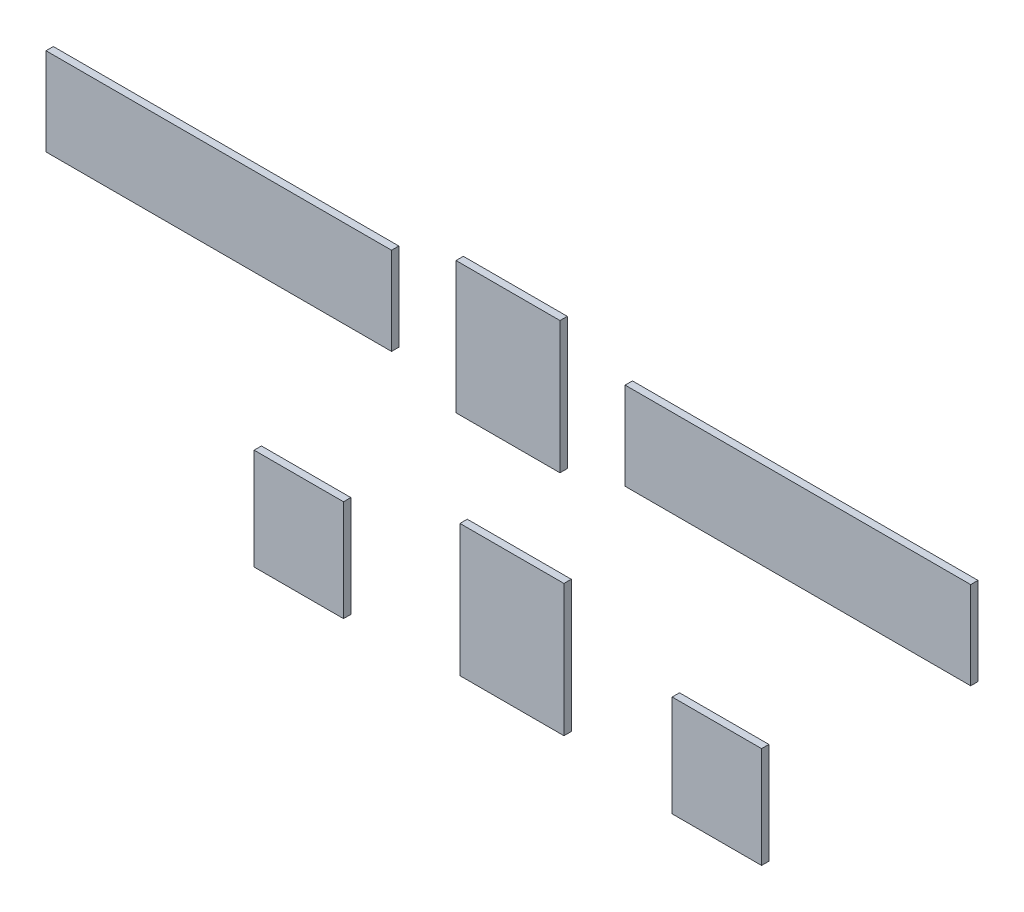
ISO-10303-21;
HEADER;
FILE_DESCRIPTION(('STEP AP214'),'2;1');
FILE_NAME('part.step','',(''),(''),'','','');
FILE_SCHEMA(('AUTOMOTIVE_DESIGN { 1 0 10303 214 1 1 1 1 }'));
ENDSEC;
DATA;
#1=APPLICATION_CONTEXT('core data for automotive mechanical design processes');
#2=APPLICATION_PROTOCOL_DEFINITION('international standard','automotive_design',2000,#1);
#3=PRODUCT_CONTEXT('',#1,'mechanical');
#4=PRODUCT('Part','Part','',(#3));
#5=PRODUCT_RELATED_PRODUCT_CATEGORY('part','',(#4));
#6=PRODUCT_DEFINITION_FORMATION('','',#4);
#7=PRODUCT_DEFINITION_CONTEXT('part definition',#1,'design');
#8=PRODUCT_DEFINITION('design','',#6,#7);
#9=PRODUCT_DEFINITION_SHAPE('','',#8);
#10=(LENGTH_UNIT() NAMED_UNIT(*) SI_UNIT(.MILLI.,.METRE.));
#11=(NAMED_UNIT(*) PLANE_ANGLE_UNIT() SI_UNIT($,.RADIAN.));
#12=(NAMED_UNIT(*) SI_UNIT($,.STERADIAN.) SOLID_ANGLE_UNIT());
#13=UNCERTAINTY_MEASURE_WITH_UNIT(LENGTH_MEASURE(1.E-05),#10,'distance_accuracy_value','');
#14=(GEOMETRIC_REPRESENTATION_CONTEXT(3) GLOBAL_UNCERTAINTY_ASSIGNED_CONTEXT((#13)) GLOBAL_UNIT_ASSIGNED_CONTEXT((#10,
#11,#12)) REPRESENTATION_CONTEXT('',''));
#15=CARTESIAN_POINT('',(0.,0.,0.));
#16=DIRECTION('',(0.,0.,1.));
#17=DIRECTION('',(1.,0.,0.));
#18=AXIS2_PLACEMENT_3D('',#15,#16,#17);
#19=CARTESIAN_POINT('',(225.816228938282,-255.644254605695,6.35));
#20=DIRECTION('',(-1.,0.,0.));
#21=DIRECTION('',(0.,0.,1.));
#22=AXIS2_PLACEMENT_3D('',#19,#20,#21);
#23=PLANE('',#22);
#24=DIRECTION('',(0.,1.,0.));
#25=VECTOR('',#24,1.);
#26=CARTESIAN_POINT('',(225.816228938282,-255.644254605695,0.));
#27=LINE('',#26,#25);
#28=CARTESIAN_POINT('',(225.816228938282,-255.644254605695,0.));
#29=VERTEX_POINT('',#28);
#30=CARTESIAN_POINT('',(225.816228938282,-167.758081574893,0.));
#31=VERTEX_POINT('',#30);
#32=EDGE_CURVE('E113',#29,#31,#27,.T.);
#33=ORIENTED_EDGE('',*,*,#32,.T.);
#34=DIRECTION('',(0.,0.,-1.));
#35=VECTOR('',#34,1.);
#36=CARTESIAN_POINT('',(225.816228938282,-167.758081574893,6.35));
#37=LINE('',#36,#35);
#38=CARTESIAN_POINT('',(225.816228938282,-167.758081574893,6.35));
#39=VERTEX_POINT('',#38);
#40=EDGE_CURVE('E12',#39,#31,#37,.T.);
#41=ORIENTED_EDGE('',*,*,#40,.F.);
#42=DIRECTION('',(0.,1.,0.));
#43=VECTOR('',#42,1.);
#44=CARTESIAN_POINT('',(225.816228938282,-255.644254605695,6.35));
#45=LINE('',#44,#43);
#46=CARTESIAN_POINT('',(225.816228938282,-255.644254605695,6.35));
#47=VERTEX_POINT('',#46);
#48=EDGE_CURVE('E101',#47,#39,#45,.T.);
#49=ORIENTED_EDGE('',*,*,#48,.F.);
#50=DIRECTION('',(0.,0.,-1.));
#51=VECTOR('',#50,1.);
#52=CARTESIAN_POINT('',(225.816228938282,-255.644254605695,6.35));
#53=LINE('',#52,#51);
#54=EDGE_CURVE('E109',#47,#29,#53,.T.);
#55=ORIENTED_EDGE('',*,*,#54,.T.);
#56=EDGE_LOOP('',(#33,#41,#49,#55));
#57=FACE_BOUND('',#56,.T.);
#58=ADVANCED_FACE('F50',(#57),#23,.F.);
#59=CARTESIAN_POINT('',(225.816228938282,-167.758081574893,6.35));
#60=DIRECTION('',(0.,-1.,0.));
#61=DIRECTION('',(0.,0.,-1.));
#62=AXIS2_PLACEMENT_3D('',#59,#60,#61);
#63=PLANE('',#62);
#64=DIRECTION('',(-1.,0.,0.));
#65=VECTOR('',#64,1.);
#66=CARTESIAN_POINT('',(225.816228938282,-167.758081574893,0.));
#67=LINE('',#66,#65);
#68=CARTESIAN_POINT('',(148.218020251067,-167.758081574893,0.));
#69=VERTEX_POINT('',#68);
#70=EDGE_CURVE('E105',#31,#69,#67,.T.);
#71=ORIENTED_EDGE('',*,*,#70,.T.);
#72=DIRECTION('',(0.,0.,-1.));
#73=VECTOR('',#72,1.);
#74=CARTESIAN_POINT('',(148.218020251067,-167.758081574893,6.35));
#75=LINE('',#74,#73);
#76=CARTESIAN_POINT('',(148.218020251067,-167.758081574893,6.35));
#77=VERTEX_POINT('',#76);
#78=EDGE_CURVE('E58',#77,#69,#75,.T.);
#79=ORIENTED_EDGE('',*,*,#78,.F.);
#80=DIRECTION('',(-1.,0.,0.));
#81=VECTOR('',#80,1.);
#82=CARTESIAN_POINT('',(225.816228938282,-167.758081574893,6.35));
#83=LINE('',#82,#81);
#84=EDGE_CURVE('E96',#39,#77,#83,.T.);
#85=ORIENTED_EDGE('',*,*,#84,.F.);
#86=ORIENTED_EDGE('',*,*,#40,.T.);
#87=EDGE_LOOP('',(#71,#79,#85,#86));
#88=FACE_BOUND('',#87,.T.);
#89=ADVANCED_FACE('F104',(#88),#63,.F.);
#90=CARTESIAN_POINT('',(148.218020251067,-255.644254605695,6.35));
#91=DIRECTION('',(1.,0.,0.));
#92=DIRECTION('',(0.,0.,-1.));
#93=AXIS2_PLACEMENT_3D('',#90,#91,#92);
#94=PLANE('',#93);
#95=DIRECTION('',(0.,-1.,0.));
#96=VECTOR('',#95,1.);
#97=CARTESIAN_POINT('',(148.218020251067,-255.644254605695,0.));
#98=LINE('',#97,#96);
#99=CARTESIAN_POINT('',(148.218020251067,-255.644254605695,0.));
#100=VERTEX_POINT('',#99);
#101=EDGE_CURVE('E83',#69,#100,#98,.T.);
#102=ORIENTED_EDGE('',*,*,#101,.T.);
#103=DIRECTION('',(0.,0.,-1.));
#104=VECTOR('',#103,1.);
#105=CARTESIAN_POINT('',(148.218020251067,-255.644254605695,6.35));
#106=LINE('',#105,#104);
#107=CARTESIAN_POINT('',(148.218020251067,-255.644254605695,6.35));
#108=VERTEX_POINT('',#107);
#109=EDGE_CURVE('E106',#108,#100,#106,.T.);
#110=ORIENTED_EDGE('',*,*,#109,.F.);
#111=DIRECTION('',(0.,-1.,0.));
#112=VECTOR('',#111,1.);
#113=CARTESIAN_POINT('',(148.218020251067,-255.644254605695,6.35));
#114=LINE('',#113,#112);
#115=EDGE_CURVE('E99',#77,#108,#114,.T.);
#116=ORIENTED_EDGE('',*,*,#115,.F.);
#117=ORIENTED_EDGE('',*,*,#78,.T.);
#118=EDGE_LOOP('',(#102,#110,#116,#117));
#119=FACE_BOUND('',#118,.T.);
#120=ADVANCED_FACE('F107',(#119),#94,.F.);
#121=CARTESIAN_POINT('',(225.816228938282,-255.644254605695,6.35));
#122=DIRECTION('',(0.,1.,0.));
#123=DIRECTION('',(0.,0.,1.));
#124=AXIS2_PLACEMENT_3D('',#121,#122,#123);
#125=PLANE('',#124);
#126=DIRECTION('',(1.,0.,0.));
#127=VECTOR('',#126,1.);
#128=CARTESIAN_POINT('',(225.816228938282,-255.644254605695,0.));
#129=LINE('',#128,#127);
#130=EDGE_CURVE('E89',#100,#29,#129,.T.);
#131=ORIENTED_EDGE('',*,*,#130,.T.);
#132=ORIENTED_EDGE('',*,*,#54,.F.);
#133=DIRECTION('',(1.,0.,0.));
#134=VECTOR('',#133,1.);
#135=CARTESIAN_POINT('',(225.816228938282,-255.644254605695,6.35));
#136=LINE('',#135,#134);
#137=EDGE_CURVE('E66',#108,#47,#136,.T.);
#138=ORIENTED_EDGE('',*,*,#137,.F.);
#139=ORIENTED_EDGE('',*,*,#109,.T.);
#140=EDGE_LOOP('',(#131,#132,#138,#139));
#141=FACE_BOUND('',#140,.T.);
#142=ADVANCED_FACE('F120',(#141),#125,.F.);
#143=CARTESIAN_POINT('',(0.,0.,6.35));
#144=DIRECTION('',(0.,0.,1.));
#145=DIRECTION('',(1.,0.,0.));
#146=AXIS2_PLACEMENT_3D('',#143,#144,#145);
#147=PLANE('',#146);
#148=ORIENTED_EDGE('',*,*,#48,.T.);
#149=ORIENTED_EDGE('',*,*,#84,.T.);
#150=ORIENTED_EDGE('',*,*,#115,.T.);
#151=ORIENTED_EDGE('',*,*,#137,.T.);
#152=EDGE_LOOP('',(#148,#149,#150,#151));
#153=FACE_BOUND('',#152,.T.);
#154=ADVANCED_FACE('F97',(#153),#147,.T.);
#155=CARTESIAN_POINT('',(0.,0.,0.));
#156=DIRECTION('',(0.,0.,1.));
#157=DIRECTION('',(1.,0.,0.));
#158=AXIS2_PLACEMENT_3D('',#155,#156,#157);
#159=PLANE('',#158);
#160=ORIENTED_EDGE('',*,*,#32,.F.);
#161=ORIENTED_EDGE('',*,*,#130,.F.);
#162=ORIENTED_EDGE('',*,*,#101,.F.);
#163=ORIENTED_EDGE('',*,*,#70,.F.);
#164=EDGE_LOOP('',(#160,#161,#162,#163));
#165=FACE_BOUND('',#164,.T.);
#166=ADVANCED_FACE('F123',(#165),#159,.F.);
#167=CLOSED_SHELL('',(#58,#89,#120,#142,#154,#166));
#168=MANIFOLD_SOLID_BREP('B2',#167);
#169=CARTESIAN_POINT('',(-137.150029144633,-251.531354882579,6.35));
#170=DIRECTION('',(-1.,0.,0.));
#171=DIRECTION('',(0.,0.,1.));
#172=AXIS2_PLACEMENT_3D('',#169,#170,#171);
#173=PLANE('',#172);
#174=DIRECTION('',(0.,1.,0.));
#175=VECTOR('',#174,1.);
#176=CARTESIAN_POINT('',(-137.150029144633,-251.531354882579,0.));
#177=LINE('',#176,#175);
#178=CARTESIAN_POINT('',(-137.150029144633,-251.531354882579,0.));
#179=VERTEX_POINT('',#178);
#180=CARTESIAN_POINT('',(-137.150029144633,-163.645181851778,0.));
#181=VERTEX_POINT('',#180);
#182=EDGE_CURVE('E247',#179,#181,#177,.T.);
#183=ORIENTED_EDGE('',*,*,#182,.T.);
#184=DIRECTION('',(0.,0.,-1.));
#185=VECTOR('',#184,1.);
#186=CARTESIAN_POINT('',(-137.150029144633,-163.645181851778,6.35));
#187=LINE('',#186,#185);
#188=CARTESIAN_POINT('',(-137.150029144633,-163.645181851778,6.35));
#189=VERTEX_POINT('',#188);
#190=EDGE_CURVE('E48',#189,#181,#187,.T.);
#191=ORIENTED_EDGE('',*,*,#190,.F.);
#192=DIRECTION('',(0.,1.,0.));
#193=VECTOR('',#192,1.);
#194=CARTESIAN_POINT('',(-137.150029144633,-251.531354882579,6.35));
#195=LINE('',#194,#193);
#196=CARTESIAN_POINT('',(-137.150029144633,-251.531354882579,6.35));
#197=VERTEX_POINT('',#196);
#198=EDGE_CURVE('E235',#197,#189,#195,.T.);
#199=ORIENTED_EDGE('',*,*,#198,.F.);
#200=DIRECTION('',(0.,0.,-1.));
#201=VECTOR('',#200,1.);
#202=CARTESIAN_POINT('',(-137.150029144633,-251.531354882579,6.35));
#203=LINE('',#202,#201);
#204=EDGE_CURVE('E243',#197,#179,#203,.T.);
#205=ORIENTED_EDGE('',*,*,#204,.T.);
#206=EDGE_LOOP('',(#183,#191,#199,#205));
#207=FACE_BOUND('',#206,.T.);
#208=ADVANCED_FACE('F184',(#207),#173,.F.);
#209=CARTESIAN_POINT('',(-137.150029144633,-163.645181851778,6.35));
#210=DIRECTION('',(0.,-1.,0.));
#211=DIRECTION('',(0.,0.,-1.));
#212=AXIS2_PLACEMENT_3D('',#209,#210,#211);
#213=PLANE('',#212);
#214=DIRECTION('',(-1.,0.,0.));
#215=VECTOR('',#214,1.);
#216=CARTESIAN_POINT('',(-137.150029144633,-163.645181851778,0.));
#217=LINE('',#216,#215);
#218=CARTESIAN_POINT('',(-214.748237831847,-163.645181851778,0.));
#219=VERTEX_POINT('',#218);
#220=EDGE_CURVE('E239',#181,#219,#217,.T.);
#221=ORIENTED_EDGE('',*,*,#220,.T.);
#222=DIRECTION('',(0.,0.,-1.));
#223=VECTOR('',#222,1.);
#224=CARTESIAN_POINT('',(-214.748237831847,-163.645181851778,6.35));
#225=LINE('',#224,#223);
#226=CARTESIAN_POINT('',(-214.748237831847,-163.645181851778,6.35));
#227=VERTEX_POINT('',#226);
#228=EDGE_CURVE('E192',#227,#219,#225,.T.);
#229=ORIENTED_EDGE('',*,*,#228,.F.);
#230=DIRECTION('',(-1.,0.,0.));
#231=VECTOR('',#230,1.);
#232=CARTESIAN_POINT('',(-137.150029144633,-163.645181851778,6.35));
#233=LINE('',#232,#231);
#234=EDGE_CURVE('E230',#189,#227,#233,.T.);
#235=ORIENTED_EDGE('',*,*,#234,.F.);
#236=ORIENTED_EDGE('',*,*,#190,.T.);
#237=EDGE_LOOP('',(#221,#229,#235,#236));
#238=FACE_BOUND('',#237,.T.);
#239=ADVANCED_FACE('F238',(#238),#213,.F.);
#240=CARTESIAN_POINT('',(-214.748237831847,-251.531354882579,6.35));
#241=DIRECTION('',(1.,0.,0.));
#242=DIRECTION('',(0.,0.,-1.));
#243=AXIS2_PLACEMENT_3D('',#240,#241,#242);
#244=PLANE('',#243);
#245=DIRECTION('',(0.,-1.,0.));
#246=VECTOR('',#245,1.);
#247=CARTESIAN_POINT('',(-214.748237831847,-251.531354882579,0.));
#248=LINE('',#247,#246);
#249=CARTESIAN_POINT('',(-214.748237831847,-251.531354882579,0.));
#250=VERTEX_POINT('',#249);
#251=EDGE_CURVE('E217',#219,#250,#248,.T.);
#252=ORIENTED_EDGE('',*,*,#251,.T.);
#253=DIRECTION('',(0.,0.,-1.));
#254=VECTOR('',#253,1.);
#255=CARTESIAN_POINT('',(-214.748237831847,-251.531354882579,6.35));
#256=LINE('',#255,#254);
#257=CARTESIAN_POINT('',(-214.748237831847,-251.531354882579,6.35));
#258=VERTEX_POINT('',#257);
#259=EDGE_CURVE('E240',#258,#250,#256,.T.);
#260=ORIENTED_EDGE('',*,*,#259,.F.);
#261=DIRECTION('',(0.,-1.,0.));
#262=VECTOR('',#261,1.);
#263=CARTESIAN_POINT('',(-214.748237831847,-251.531354882579,6.35));
#264=LINE('',#263,#262);
#265=EDGE_CURVE('E233',#227,#258,#264,.T.);
#266=ORIENTED_EDGE('',*,*,#265,.F.);
#267=ORIENTED_EDGE('',*,*,#228,.T.);
#268=EDGE_LOOP('',(#252,#260,#266,#267));
#269=FACE_BOUND('',#268,.T.);
#270=ADVANCED_FACE('F241',(#269),#244,.F.);
#271=CARTESIAN_POINT('',(-137.150029144633,-251.531354882579,6.35));
#272=DIRECTION('',(0.,1.,0.));
#273=DIRECTION('',(0.,0.,1.));
#274=AXIS2_PLACEMENT_3D('',#271,#272,#273);
#275=PLANE('',#274);
#276=DIRECTION('',(1.,0.,0.));
#277=VECTOR('',#276,1.);
#278=CARTESIAN_POINT('',(-137.150029144633,-251.531354882579,0.));
#279=LINE('',#278,#277);
#280=EDGE_CURVE('E223',#250,#179,#279,.T.);
#281=ORIENTED_EDGE('',*,*,#280,.T.);
#282=ORIENTED_EDGE('',*,*,#204,.F.);
#283=DIRECTION('',(1.,0.,0.));
#284=VECTOR('',#283,1.);
#285=CARTESIAN_POINT('',(-137.150029144633,-251.531354882579,6.35));
#286=LINE('',#285,#284);
#287=EDGE_CURVE('E200',#258,#197,#286,.T.);
#288=ORIENTED_EDGE('',*,*,#287,.F.);
#289=ORIENTED_EDGE('',*,*,#259,.T.);
#290=EDGE_LOOP('',(#281,#282,#288,#289));
#291=FACE_BOUND('',#290,.T.);
#292=ADVANCED_FACE('F254',(#291),#275,.F.);
#293=CARTESIAN_POINT('',(0.,0.,6.35));
#294=DIRECTION('',(0.,0.,1.));
#295=DIRECTION('',(1.,0.,0.));
#296=AXIS2_PLACEMENT_3D('',#293,#294,#295);
#297=PLANE('',#296);
#298=ORIENTED_EDGE('',*,*,#198,.T.);
#299=ORIENTED_EDGE('',*,*,#234,.T.);
#300=ORIENTED_EDGE('',*,*,#265,.T.);
#301=ORIENTED_EDGE('',*,*,#287,.T.);
#302=EDGE_LOOP('',(#298,#299,#300,#301));
#303=FACE_BOUND('',#302,.T.);
#304=ADVANCED_FACE('F231',(#303),#297,.T.);
#305=CARTESIAN_POINT('',(0.,0.,0.));
#306=DIRECTION('',(0.,0.,1.));
#307=DIRECTION('',(1.,0.,0.));
#308=AXIS2_PLACEMENT_3D('',#305,#306,#307);
#309=PLANE('',#308);
#310=ORIENTED_EDGE('',*,*,#182,.F.);
#311=ORIENTED_EDGE('',*,*,#280,.F.);
#312=ORIENTED_EDGE('',*,*,#251,.F.);
#313=ORIENTED_EDGE('',*,*,#220,.F.);
#314=EDGE_LOOP('',(#310,#311,#312,#313));
#315=FACE_BOUND('',#314,.T.);
#316=ADVANCED_FACE('F257',(#315),#309,.F.);
#317=CLOSED_SHELL('',(#208,#239,#270,#292,#304,#316));
#318=MANIFOLD_SOLID_BREP('B6',#317);
#319=CARTESIAN_POINT('',(54.22809591171,-243.893395850462,6.35));
#320=DIRECTION('',(-1.,0.,0.));
#321=DIRECTION('',(0.,0.,1.));
#322=AXIS2_PLACEMENT_3D('',#319,#320,#321);
#323=PLANE('',#322);
#324=DIRECTION('',(0.,1.,0.));
#325=VECTOR('',#324,1.);
#326=CARTESIAN_POINT('',(54.22809591171,-243.893395850462,0.));
#327=LINE('',#326,#325);
#328=CARTESIAN_POINT('',(54.22809591171,-243.893395850462,0.));
#329=VERTEX_POINT('',#328);
#330=CARTESIAN_POINT('',(54.22809591171,-129.370585139137,0.));
#331=VERTEX_POINT('',#330);
#332=EDGE_CURVE('E381',#329,#331,#327,.T.);
#333=ORIENTED_EDGE('',*,*,#332,.T.);
#334=DIRECTION('',(0.,0.,-1.));
#335=VECTOR('',#334,1.);
#336=CARTESIAN_POINT('',(54.22809591171,-129.370585139137,6.35));
#337=LINE('',#336,#335);
#338=CARTESIAN_POINT('',(54.22809591171,-129.370585139137,6.35));
#339=VERTEX_POINT('',#338);
#340=EDGE_CURVE('E182',#339,#331,#337,.T.);
#341=ORIENTED_EDGE('',*,*,#340,.F.);
#342=DIRECTION('',(0.,1.,0.));
#343=VECTOR('',#342,1.);
#344=CARTESIAN_POINT('',(54.22809591171,-243.893395850462,6.35));
#345=LINE('',#344,#343);
#346=CARTESIAN_POINT('',(54.22809591171,-243.893395850462,6.35));
#347=VERTEX_POINT('',#346);
#348=EDGE_CURVE('E369',#347,#339,#345,.T.);
#349=ORIENTED_EDGE('',*,*,#348,.F.);
#350=DIRECTION('',(0.,0.,-1.));
#351=VECTOR('',#350,1.);
#352=CARTESIAN_POINT('',(54.22809591171,-243.893395850462,6.35));
#353=LINE('',#352,#351);
#354=EDGE_CURVE('E377',#347,#329,#353,.T.);
#355=ORIENTED_EDGE('',*,*,#354,.T.);
#356=EDGE_LOOP('',(#333,#341,#349,#355));
#357=FACE_BOUND('',#356,.T.);
#358=ADVANCED_FACE('F318',(#357),#323,.F.);
#359=CARTESIAN_POINT('',(54.22809591171,-129.370585139137,6.35));
#360=DIRECTION('',(0.,-1.,0.));
#361=DIRECTION('',(0.,0.,-1.));
#362=AXIS2_PLACEMENT_3D('',#359,#360,#361);
#363=PLANE('',#362);
#364=DIRECTION('',(-1.,0.,0.));
#365=VECTOR('',#364,1.);
#366=CARTESIAN_POINT('',(54.22809591171,-129.370585139137,0.));
#367=LINE('',#366,#365);
#368=CARTESIAN_POINT('',(-36.0277995187768,-129.370585139137,0.));
#369=VERTEX_POINT('',#368);
#370=EDGE_CURVE('E373',#331,#369,#367,.T.);
#371=ORIENTED_EDGE('',*,*,#370,.T.);
#372=DIRECTION('',(0.,0.,-1.));
#373=VECTOR('',#372,1.);
#374=CARTESIAN_POINT('',(-36.0277995187768,-129.370585139137,6.35));
#375=LINE('',#374,#373);
#376=CARTESIAN_POINT('',(-36.0277995187768,-129.370585139137,6.35));
#377=VERTEX_POINT('',#376);
#378=EDGE_CURVE('E326',#377,#369,#375,.T.);
#379=ORIENTED_EDGE('',*,*,#378,.F.);
#380=DIRECTION('',(-1.,0.,0.));
#381=VECTOR('',#380,1.);
#382=CARTESIAN_POINT('',(54.22809591171,-129.370585139137,6.35));
#383=LINE('',#382,#381);
#384=EDGE_CURVE('E364',#339,#377,#383,.T.);
#385=ORIENTED_EDGE('',*,*,#384,.F.);
#386=ORIENTED_EDGE('',*,*,#340,.T.);
#387=EDGE_LOOP('',(#371,#379,#385,#386));
#388=FACE_BOUND('',#387,.T.);
#389=ADVANCED_FACE('F372',(#388),#363,.F.);
#390=CARTESIAN_POINT('',(-36.0277995187768,-243.893395850462,6.35));
#391=DIRECTION('',(1.,0.,0.));
#392=DIRECTION('',(0.,0.,-1.));
#393=AXIS2_PLACEMENT_3D('',#390,#391,#392);
#394=PLANE('',#393);
#395=DIRECTION('',(0.,-1.,0.));
#396=VECTOR('',#395,1.);
#397=CARTESIAN_POINT('',(-36.0277995187768,-243.893395850462,0.));
#398=LINE('',#397,#396);
#399=CARTESIAN_POINT('',(-36.0277995187768,-243.893395850462,0.));
#400=VERTEX_POINT('',#399);
#401=EDGE_CURVE('E351',#369,#400,#398,.T.);
#402=ORIENTED_EDGE('',*,*,#401,.T.);
#403=DIRECTION('',(0.,0.,-1.));
#404=VECTOR('',#403,1.);
#405=CARTESIAN_POINT('',(-36.0277995187768,-243.893395850462,6.35));
#406=LINE('',#405,#404);
#407=CARTESIAN_POINT('',(-36.0277995187768,-243.893395850462,6.35));
#408=VERTEX_POINT('',#407);
#409=EDGE_CURVE('E374',#408,#400,#406,.T.);
#410=ORIENTED_EDGE('',*,*,#409,.F.);
#411=DIRECTION('',(0.,-1.,0.));
#412=VECTOR('',#411,1.);
#413=CARTESIAN_POINT('',(-36.0277995187768,-243.893395850462,6.35));
#414=LINE('',#413,#412);
#415=EDGE_CURVE('E367',#377,#408,#414,.T.);
#416=ORIENTED_EDGE('',*,*,#415,.F.);
#417=ORIENTED_EDGE('',*,*,#378,.T.);
#418=EDGE_LOOP('',(#402,#410,#416,#417));
#419=FACE_BOUND('',#418,.T.);
#420=ADVANCED_FACE('F375',(#419),#394,.F.);
#421=CARTESIAN_POINT('',(54.22809591171,-243.893395850462,6.35));
#422=DIRECTION('',(0.,1.,0.));
#423=DIRECTION('',(0.,0.,1.));
#424=AXIS2_PLACEMENT_3D('',#421,#422,#423);
#425=PLANE('',#424);
#426=DIRECTION('',(1.,0.,0.));
#427=VECTOR('',#426,1.);
#428=CARTESIAN_POINT('',(54.22809591171,-243.893395850462,0.));
#429=LINE('',#428,#427);
#430=EDGE_CURVE('E357',#400,#329,#429,.T.);
#431=ORIENTED_EDGE('',*,*,#430,.T.);
#432=ORIENTED_EDGE('',*,*,#354,.F.);
#433=DIRECTION('',(1.,0.,0.));
#434=VECTOR('',#433,1.);
#435=CARTESIAN_POINT('',(54.22809591171,-243.893395850462,6.35));
#436=LINE('',#435,#434);
#437=EDGE_CURVE('E334',#408,#347,#436,.T.);
#438=ORIENTED_EDGE('',*,*,#437,.F.);
#439=ORIENTED_EDGE('',*,*,#409,.T.);
#440=EDGE_LOOP('',(#431,#432,#438,#439));
#441=FACE_BOUND('',#440,.T.);
#442=ADVANCED_FACE('F388',(#441),#425,.F.);
#443=CARTESIAN_POINT('',(0.,0.,6.35));
#444=DIRECTION('',(0.,0.,1.));
#445=DIRECTION('',(1.,0.,0.));
#446=AXIS2_PLACEMENT_3D('',#443,#444,#445);
#447=PLANE('',#446);
#448=ORIENTED_EDGE('',*,*,#348,.T.);
#449=ORIENTED_EDGE('',*,*,#384,.T.);
#450=ORIENTED_EDGE('',*,*,#415,.T.);
#451=ORIENTED_EDGE('',*,*,#437,.T.);
#452=EDGE_LOOP('',(#448,#449,#450,#451));
#453=FACE_BOUND('',#452,.T.);
#454=ADVANCED_FACE('F365',(#453),#447,.T.);
#455=CARTESIAN_POINT('',(0.,0.,0.));
#456=DIRECTION('',(0.,0.,1.));
#457=DIRECTION('',(1.,0.,0.));
#458=AXIS2_PLACEMENT_3D('',#455,#456,#457);
#459=PLANE('',#458);
#460=ORIENTED_EDGE('',*,*,#332,.F.);
#461=ORIENTED_EDGE('',*,*,#430,.F.);
#462=ORIENTED_EDGE('',*,*,#401,.F.);
#463=ORIENTED_EDGE('',*,*,#370,.F.);
#464=EDGE_LOOP('',(#460,#461,#462,#463));
#465=FACE_BOUND('',#464,.T.);
#466=ADVANCED_FACE('F391',(#465),#459,.F.);
#467=CLOSED_SHELL('',(#358,#389,#420,#442,#454,#466));
#468=MANIFOLD_SOLID_BREP('B42',#467);
#469=CARTESIAN_POINT('',(50.7759549899108,-47.934987268263,6.35));
#470=DIRECTION('',(-1.,0.,0.));
#471=DIRECTION('',(0.,0.,1.));
#472=AXIS2_PLACEMENT_3D('',#469,#470,#471);
#473=PLANE('',#472);
#474=DIRECTION('',(0.,1.,0.));
#475=VECTOR('',#474,1.);
#476=CARTESIAN_POINT('',(50.7759549899108,-47.934987268263,0.));
#477=LINE('',#476,#475);
#478=CARTESIAN_POINT('',(50.7759549899108,-47.934987268263,0.));
#479=VERTEX_POINT('',#478);
#480=CARTESIAN_POINT('',(50.7759549899108,66.5878234430621,0.));
#481=VERTEX_POINT('',#480);
#482=EDGE_CURVE('E515',#479,#481,#477,.T.);
#483=ORIENTED_EDGE('',*,*,#482,.T.);
#484=DIRECTION('',(0.,0.,-1.));
#485=VECTOR('',#484,1.);
#486=CARTESIAN_POINT('',(50.7759549899108,66.5878234430621,6.35));
#487=LINE('',#486,#485);
#488=CARTESIAN_POINT('',(50.7759549899108,66.5878234430621,6.35));
#489=VERTEX_POINT('',#488);
#490=EDGE_CURVE('E316',#489,#481,#487,.T.);
#491=ORIENTED_EDGE('',*,*,#490,.F.);
#492=DIRECTION('',(0.,1.,0.));
#493=VECTOR('',#492,1.);
#494=CARTESIAN_POINT('',(50.7759549899108,-47.934987268263,6.35));
#495=LINE('',#494,#493);
#496=CARTESIAN_POINT('',(50.7759549899108,-47.934987268263,6.35));
#497=VERTEX_POINT('',#496);
#498=EDGE_CURVE('E503',#497,#489,#495,.T.);
#499=ORIENTED_EDGE('',*,*,#498,.F.);
#500=DIRECTION('',(0.,0.,-1.));
#501=VECTOR('',#500,1.);
#502=CARTESIAN_POINT('',(50.7759549899108,-47.934987268263,6.35));
#503=LINE('',#502,#501);
#504=EDGE_CURVE('E511',#497,#479,#503,.T.);
#505=ORIENTED_EDGE('',*,*,#504,.T.);
#506=EDGE_LOOP('',(#483,#491,#499,#505));
#507=FACE_BOUND('',#506,.T.);
#508=ADVANCED_FACE('F452',(#507),#473,.F.);
#509=CARTESIAN_POINT('',(50.7759549899108,66.5878234430621,6.35));
#510=DIRECTION('',(0.,-1.,0.));
#511=DIRECTION('',(1.,0.,0.));
#512=AXIS2_PLACEMENT_3D('',#509,#510,#511);
#513=PLANE('',#512);
#514=DIRECTION('',(-1.,0.,0.));
#515=VECTOR('',#514,1.);
#516=CARTESIAN_POINT('',(50.7759549899108,66.5878234430621,0.));
#517=LINE('',#516,#515);
#518=CARTESIAN_POINT('',(-39.479940440576,66.5878234430621,0.));
#519=VERTEX_POINT('',#518);
#520=EDGE_CURVE('E507',#481,#519,#517,.T.);
#521=ORIENTED_EDGE('',*,*,#520,.T.);
#522=DIRECTION('',(0.,0.,-1.));
#523=VECTOR('',#522,1.);
#524=CARTESIAN_POINT('',(-39.479940440576,66.5878234430621,6.35));
#525=LINE('',#524,#523);
#526=CARTESIAN_POINT('',(-39.479940440576,66.5878234430621,6.35));
#527=VERTEX_POINT('',#526);
#528=EDGE_CURVE('E460',#527,#519,#525,.T.);
#529=ORIENTED_EDGE('',*,*,#528,.F.);
#530=DIRECTION('',(-1.,0.,0.));
#531=VECTOR('',#530,1.);
#532=CARTESIAN_POINT('',(50.7759549899108,66.5878234430621,6.35));
#533=LINE('',#532,#531);
#534=EDGE_CURVE('E498',#489,#527,#533,.T.);
#535=ORIENTED_EDGE('',*,*,#534,.F.);
#536=ORIENTED_EDGE('',*,*,#490,.T.);
#537=EDGE_LOOP('',(#521,#529,#535,#536));
#538=FACE_BOUND('',#537,.T.);
#539=ADVANCED_FACE('F506',(#538),#513,.F.);
#540=CARTESIAN_POINT('',(-39.479940440576,-47.9349872682631,6.35));
#541=DIRECTION('',(1.,0.,0.));
#542=DIRECTION('',(0.,0.,-1.));
#543=AXIS2_PLACEMENT_3D('',#540,#541,#542);
#544=PLANE('',#543);
#545=DIRECTION('',(0.,-1.,0.));
#546=VECTOR('',#545,1.);
#547=CARTESIAN_POINT('',(-39.479940440576,-47.9349872682631,0.));
#548=LINE('',#547,#546);
#549=CARTESIAN_POINT('',(-39.479940440576,-47.9349872682631,0.));
#550=VERTEX_POINT('',#549);
#551=EDGE_CURVE('E485',#519,#550,#548,.T.);
#552=ORIENTED_EDGE('',*,*,#551,.T.);
#553=DIRECTION('',(0.,0.,-1.));
#554=VECTOR('',#553,1.);
#555=CARTESIAN_POINT('',(-39.479940440576,-47.9349872682631,6.35));
#556=LINE('',#555,#554);
#557=CARTESIAN_POINT('',(-39.479940440576,-47.9349872682631,6.35));
#558=VERTEX_POINT('',#557);
#559=EDGE_CURVE('E508',#558,#550,#556,.T.);
#560=ORIENTED_EDGE('',*,*,#559,.F.);
#561=DIRECTION('',(0.,-1.,0.));
#562=VECTOR('',#561,1.);
#563=CARTESIAN_POINT('',(-39.479940440576,-47.9349872682631,6.35));
#564=LINE('',#563,#562);
#565=EDGE_CURVE('E501',#527,#558,#564,.T.);
#566=ORIENTED_EDGE('',*,*,#565,.F.);
#567=ORIENTED_EDGE('',*,*,#528,.T.);
#568=EDGE_LOOP('',(#552,#560,#566,#567));
#569=FACE_BOUND('',#568,.T.);
#570=ADVANCED_FACE('F509',(#569),#544,.F.);
#571=CARTESIAN_POINT('',(50.7759549899108,-47.934987268263,6.35));
#572=DIRECTION('',(0.,1.,0.));
#573=DIRECTION('',(-1.,0.,0.));
#574=AXIS2_PLACEMENT_3D('',#571,#572,#573);
#575=PLANE('',#574);
#576=DIRECTION('',(1.,0.,0.));
#577=VECTOR('',#576,1.);
#578=CARTESIAN_POINT('',(50.7759549899108,-47.934987268263,0.));
#579=LINE('',#578,#577);
#580=EDGE_CURVE('E491',#550,#479,#579,.T.);
#581=ORIENTED_EDGE('',*,*,#580,.T.);
#582=ORIENTED_EDGE('',*,*,#504,.F.);
#583=DIRECTION('',(1.,0.,0.));
#584=VECTOR('',#583,1.);
#585=CARTESIAN_POINT('',(50.7759549899108,-47.934987268263,6.35));
#586=LINE('',#585,#584);
#587=EDGE_CURVE('E468',#558,#497,#586,.T.);
#588=ORIENTED_EDGE('',*,*,#587,.F.);
#589=ORIENTED_EDGE('',*,*,#559,.T.);
#590=EDGE_LOOP('',(#581,#582,#588,#589));
#591=FACE_BOUND('',#590,.T.);
#592=ADVANCED_FACE('F522',(#591),#575,.F.);
#593=CARTESIAN_POINT('',(0.,0.,6.35));
#594=DIRECTION('',(0.,0.,1.));
#595=DIRECTION('',(1.,0.,0.));
#596=AXIS2_PLACEMENT_3D('',#593,#594,#595);
#597=PLANE('',#596);
#598=ORIENTED_EDGE('',*,*,#498,.T.);
#599=ORIENTED_EDGE('',*,*,#534,.T.);
#600=ORIENTED_EDGE('',*,*,#565,.T.);
#601=ORIENTED_EDGE('',*,*,#587,.T.);
#602=EDGE_LOOP('',(#598,#599,#600,#601));
#603=FACE_BOUND('',#602,.T.);
#604=ADVANCED_FACE('F499',(#603),#597,.T.);
#605=CARTESIAN_POINT('',(0.,0.,0.));
#606=DIRECTION('',(0.,0.,1.));
#607=DIRECTION('',(1.,0.,0.));
#608=AXIS2_PLACEMENT_3D('',#605,#606,#607);
#609=PLANE('',#608);
#610=ORIENTED_EDGE('',*,*,#482,.F.);
#611=ORIENTED_EDGE('',*,*,#580,.F.);
#612=ORIENTED_EDGE('',*,*,#551,.F.);
#613=ORIENTED_EDGE('',*,*,#520,.F.);
#614=EDGE_LOOP('',(#610,#611,#612,#613));
#615=FACE_BOUND('',#614,.T.);
#616=ADVANCED_FACE('F525',(#615),#609,.F.);
#617=CLOSED_SHELL('',(#508,#539,#570,#592,#604,#616));
#618=MANIFOLD_SOLID_BREP('B176',#617);
#619=CARTESIAN_POINT('',(-95.4431949848876,-29.7781607596672,6.35));
#620=DIRECTION('',(-1.,0.,0.));
#621=DIRECTION('',(0.,0.,1.));
#622=AXIS2_PLACEMENT_3D('',#619,#620,#621);
#623=PLANE('',#622);
#624=DIRECTION('',(0.,1.,0.));
#625=VECTOR('',#624,1.);
#626=CARTESIAN_POINT('',(-95.4431949848876,-29.7781607596672,0.));
#627=LINE('',#626,#625);
#628=CARTESIAN_POINT('',(-95.4431949848876,-29.7781607596672,0.));
#629=VERTEX_POINT('',#628);
#630=CARTESIAN_POINT('',(-95.4431949848876,46.3300696869815,0.));
#631=VERTEX_POINT('',#630);
#632=EDGE_CURVE('E648',#629,#631,#627,.T.);
#633=ORIENTED_EDGE('',*,*,#632,.T.);
#634=DIRECTION('',(0.,0.,-1.));
#635=VECTOR('',#634,1.);
#636=CARTESIAN_POINT('',(-95.4431949848876,46.3300696869815,6.35));
#637=LINE('',#636,#635);
#638=CARTESIAN_POINT('',(-95.4431949848876,46.3300696869815,6.35));
#639=VERTEX_POINT('',#638);
#640=EDGE_CURVE('E450',#639,#631,#637,.T.);
#641=ORIENTED_EDGE('',*,*,#640,.F.);
#642=DIRECTION('',(0.,1.,0.));
#643=VECTOR('',#642,1.);
#644=CARTESIAN_POINT('',(-95.4431949848876,-29.7781607596672,6.35));
#645=LINE('',#644,#643);
#646=CARTESIAN_POINT('',(-95.4431949848876,-29.7781607596672,6.35));
#647=VERTEX_POINT('',#646);
#648=EDGE_CURVE('E636',#647,#639,#645,.T.);
#649=ORIENTED_EDGE('',*,*,#648,.F.);
#650=DIRECTION('',(0.,0.,-1.));
#651=VECTOR('',#650,1.);
#652=CARTESIAN_POINT('',(-95.4431949848876,-29.7781607596672,6.35));
#653=LINE('',#652,#651);
#654=EDGE_CURVE('E644',#647,#629,#653,.T.);
#655=ORIENTED_EDGE('',*,*,#654,.T.);
#656=EDGE_LOOP('',(#633,#641,#649,#655));
#657=FACE_BOUND('',#656,.T.);
#658=ADVANCED_FACE('F585',(#657),#623,.F.);
#659=CARTESIAN_POINT('',(-95.4431949848876,46.3300696869815,6.35));
#660=DIRECTION('',(0.,-1.,0.));
#661=DIRECTION('',(1.,0.,0.));
#662=AXIS2_PLACEMENT_3D('',#659,#660,#661);
#663=PLANE('',#662);
#664=DIRECTION('',(-1.,0.,0.));
#665=VECTOR('',#664,1.);
#666=CARTESIAN_POINT('',(-95.4431949848876,46.3300696869815,0.));
#667=LINE('',#666,#665);
#668=CARTESIAN_POINT('',(-395.443194984888,46.3300696869815,0.));
#669=VERTEX_POINT('',#668);
#670=EDGE_CURVE('E640',#631,#669,#667,.T.);
#671=ORIENTED_EDGE('',*,*,#670,.T.);
#672=DIRECTION('',(0.,0.,-1.));
#673=VECTOR('',#672,1.);
#674=CARTESIAN_POINT('',(-395.443194984888,46.3300696869815,6.35));
#675=LINE('',#674,#673);
#676=CARTESIAN_POINT('',(-395.443194984888,46.3300696869815,6.35));
#677=VERTEX_POINT('',#676);
#678=EDGE_CURVE('E593',#677,#669,#675,.T.);
#679=ORIENTED_EDGE('',*,*,#678,.F.);
#680=DIRECTION('',(-1.,0.,0.));
#681=VECTOR('',#680,1.);
#682=CARTESIAN_POINT('',(-95.4431949848876,46.3300696869815,6.35));
#683=LINE('',#682,#681);
#684=EDGE_CURVE('E631',#639,#677,#683,.T.);
#685=ORIENTED_EDGE('',*,*,#684,.F.);
#686=ORIENTED_EDGE('',*,*,#640,.T.);
#687=EDGE_LOOP('',(#671,#679,#685,#686));
#688=FACE_BOUND('',#687,.T.);
#689=ADVANCED_FACE('F639',(#688),#663,.F.);
#690=CARTESIAN_POINT('',(-395.443194984888,-29.7781607596673,6.35));
#691=DIRECTION('',(1.,0.,0.));
#692=DIRECTION('',(0.,0.,-1.));
#693=AXIS2_PLACEMENT_3D('',#690,#691,#692);
#694=PLANE('',#693);
#695=DIRECTION('',(0.,-1.,0.));
#696=VECTOR('',#695,1.);
#697=CARTESIAN_POINT('',(-395.443194984888,-29.7781607596673,0.));
#698=LINE('',#697,#696);
#699=CARTESIAN_POINT('',(-395.443194984888,-29.7781607596673,0.));
#700=VERTEX_POINT('',#699);
#701=EDGE_CURVE('E618',#669,#700,#698,.T.);
#702=ORIENTED_EDGE('',*,*,#701,.T.);
#703=DIRECTION('',(0.,0.,-1.));
#704=VECTOR('',#703,1.);
#705=CARTESIAN_POINT('',(-395.443194984888,-29.7781607596673,6.35));
#706=LINE('',#705,#704);
#707=CARTESIAN_POINT('',(-395.443194984888,-29.7781607596673,6.35));
#708=VERTEX_POINT('',#707);
#709=EDGE_CURVE('E641',#708,#700,#706,.T.);
#710=ORIENTED_EDGE('',*,*,#709,.F.);
#711=DIRECTION('',(0.,-1.,0.));
#712=VECTOR('',#711,1.);
#713=CARTESIAN_POINT('',(-395.443194984888,-29.7781607596673,6.35));
#714=LINE('',#713,#712);
#715=EDGE_CURVE('E634',#677,#708,#714,.T.);
#716=ORIENTED_EDGE('',*,*,#715,.F.);
#717=ORIENTED_EDGE('',*,*,#678,.T.);
#718=EDGE_LOOP('',(#702,#710,#716,#717));
#719=FACE_BOUND('',#718,.T.);
#720=ADVANCED_FACE('F642',(#719),#694,.F.);
#721=CARTESIAN_POINT('',(-95.4431949848876,-29.7781607596672,6.35));
#722=DIRECTION('',(0.,1.,0.));
#723=DIRECTION('',(-1.,0.,0.));
#724=AXIS2_PLACEMENT_3D('',#721,#722,#723);
#725=PLANE('',#724);
#726=DIRECTION('',(1.,0.,0.));
#727=VECTOR('',#726,1.);
#728=CARTESIAN_POINT('',(-95.4431949848876,-29.7781607596672,0.));
#729=LINE('',#728,#727);
#730=EDGE_CURVE('E624',#700,#629,#729,.T.);
#731=ORIENTED_EDGE('',*,*,#730,.T.);
#732=ORIENTED_EDGE('',*,*,#654,.F.);
#733=DIRECTION('',(1.,0.,0.));
#734=VECTOR('',#733,1.);
#735=CARTESIAN_POINT('',(-95.4431949848876,-29.7781607596672,6.35));
#736=LINE('',#735,#734);
#737=EDGE_CURVE('E601',#708,#647,#736,.T.);
#738=ORIENTED_EDGE('',*,*,#737,.F.);
#739=ORIENTED_EDGE('',*,*,#709,.T.);
#740=EDGE_LOOP('',(#731,#732,#738,#739));
#741=FACE_BOUND('',#740,.T.);
#742=ADVANCED_FACE('F655',(#741),#725,.F.);
#743=CARTESIAN_POINT('',(0.,0.,6.35));
#744=DIRECTION('',(0.,0.,1.));
#745=DIRECTION('',(1.,0.,0.));
#746=AXIS2_PLACEMENT_3D('',#743,#744,#745);
#747=PLANE('',#746);
#748=ORIENTED_EDGE('',*,*,#648,.T.);
#749=ORIENTED_EDGE('',*,*,#684,.T.);
#750=ORIENTED_EDGE('',*,*,#715,.T.);
#751=ORIENTED_EDGE('',*,*,#737,.T.);
#752=EDGE_LOOP('',(#748,#749,#750,#751));
#753=FACE_BOUND('',#752,.T.);
#754=ADVANCED_FACE('F632',(#753),#747,.T.);
#755=CARTESIAN_POINT('',(0.,0.,0.));
#756=DIRECTION('',(0.,0.,1.));
#757=DIRECTION('',(1.,0.,0.));
#758=AXIS2_PLACEMENT_3D('',#755,#756,#757);
#759=PLANE('',#758);
#760=ORIENTED_EDGE('',*,*,#632,.F.);
#761=ORIENTED_EDGE('',*,*,#730,.F.);
#762=ORIENTED_EDGE('',*,*,#701,.F.);
#763=ORIENTED_EDGE('',*,*,#670,.F.);
#764=EDGE_LOOP('',(#760,#761,#762,#763));
#765=FACE_BOUND('',#764,.T.);
#766=ADVANCED_FACE('F658',(#765),#759,.F.);
#767=CLOSED_SHELL('',(#658,#689,#720,#742,#754,#766));
#768=MANIFOLD_SOLID_BREP('B310',#767);
#769=CARTESIAN_POINT('',(407.356805015103,-29.7781607596672,6.35));
#770=DIRECTION('',(-1.,0.,0.));
#771=DIRECTION('',(0.,0.,1.));
#772=AXIS2_PLACEMENT_3D('',#769,#770,#771);
#773=PLANE('',#772);
#774=DIRECTION('',(0.,1.,0.));
#775=VECTOR('',#774,1.);
#776=CARTESIAN_POINT('',(407.356805015103,-29.7781607596672,0.));
#777=LINE('',#776,#775);
#778=CARTESIAN_POINT('',(407.356805015103,-29.7781607596672,0.));
#779=VERTEX_POINT('',#778);
#780=CARTESIAN_POINT('',(407.356805015103,46.3300696869816,0.));
#781=VERTEX_POINT('',#780);
#782=EDGE_CURVE('E777',#779,#781,#777,.T.);
#783=ORIENTED_EDGE('',*,*,#782,.T.);
#784=DIRECTION('',(0.,0.,-1.));
#785=VECTOR('',#784,1.);
#786=CARTESIAN_POINT('',(407.356805015103,46.3300696869816,6.35));
#787=LINE('',#786,#785);
#788=CARTESIAN_POINT('',(407.356805015103,46.3300696869816,6.35));
#789=VERTEX_POINT('',#788);
#790=EDGE_CURVE('E583',#789,#781,#787,.T.);
#791=ORIENTED_EDGE('',*,*,#790,.F.);
#792=DIRECTION('',(0.,1.,0.));
#793=VECTOR('',#792,1.);
#794=CARTESIAN_POINT('',(407.356805015103,-29.7781607596672,6.35));
#795=LINE('',#794,#793);
#796=CARTESIAN_POINT('',(407.356805015103,-29.7781607596672,6.35));
#797=VERTEX_POINT('',#796);
#798=EDGE_CURVE('E761',#797,#789,#795,.T.);
#799=ORIENTED_EDGE('',*,*,#798,.F.);
#800=DIRECTION('',(0.,0.,-1.));
#801=VECTOR('',#800,1.);
#802=CARTESIAN_POINT('',(407.356805015103,-29.7781607596672,6.35));
#803=LINE('',#802,#801);
#804=EDGE_CURVE('E773',#797,#779,#803,.T.);
#805=ORIENTED_EDGE('',*,*,#804,.T.);
#806=EDGE_LOOP('',(#783,#791,#799,#805));
#807=FACE_BOUND('',#806,.T.);
#808=ADVANCED_FACE('F709',(#807),#773,.F.);
#809=CARTESIAN_POINT('',(407.356805015103,46.3300696869816,6.35));
#810=DIRECTION('',(0.,-1.,0.));
#811=DIRECTION('',(1.,0.,0.));
#812=AXIS2_PLACEMENT_3D('',#809,#810,#811);
#813=PLANE('',#812);
#814=DIRECTION('',(-1.,0.,0.));
#815=VECTOR('',#814,1.);
#816=CARTESIAN_POINT('',(407.356805015103,46.3300696869816,0.));
#817=LINE('',#816,#815);
#818=CARTESIAN_POINT('',(107.356805015103,46.3300696869815,0.));
#819=VERTEX_POINT('',#818);
#820=EDGE_CURVE('E766',#781,#819,#817,.T.);
#821=ORIENTED_EDGE('',*,*,#820,.T.);
#822=DIRECTION('',(0.,0.,-1.));
#823=VECTOR('',#822,1.);
#824=CARTESIAN_POINT('',(107.356805015103,46.3300696869815,6.35));
#825=LINE('',#824,#823);
#826=CARTESIAN_POINT('',(107.356805015103,46.3300696869815,6.35));
#827=VERTEX_POINT('',#826);
#828=EDGE_CURVE('E718',#827,#819,#825,.T.);
#829=ORIENTED_EDGE('',*,*,#828,.F.);
#830=DIRECTION('',(-1.,0.,0.));
#831=VECTOR('',#830,1.);
#832=CARTESIAN_POINT('',(407.356805015103,46.3300696869816,6.35));
#833=LINE('',#832,#831);
#834=EDGE_CURVE('E756',#789,#827,#833,.T.);
#835=ORIENTED_EDGE('',*,*,#834,.F.);
#836=ORIENTED_EDGE('',*,*,#790,.T.);
#837=EDGE_LOOP('',(#821,#829,#835,#836));
#838=FACE_BOUND('',#837,.T.);
#839=ADVANCED_FACE('F765',(#838),#813,.F.);
#840=CARTESIAN_POINT('',(107.356805015103,-29.7781607596672,6.35));
#841=DIRECTION('',(1.,0.,0.));
#842=DIRECTION('',(0.,0.,-1.));
#843=AXIS2_PLACEMENT_3D('',#840,#841,#842);
#844=PLANE('',#843);
#845=DIRECTION('',(0.,-1.,0.));
#846=VECTOR('',#845,1.);
#847=CARTESIAN_POINT('',(107.356805015103,-29.7781607596672,0.));
#848=LINE('',#847,#846);
#849=CARTESIAN_POINT('',(107.356805015103,-29.7781607596672,0.));
#850=VERTEX_POINT('',#849);
#851=EDGE_CURVE('E743',#819,#850,#848,.T.);
#852=ORIENTED_EDGE('',*,*,#851,.T.);
#853=DIRECTION('',(0.,0.,-1.));
#854=VECTOR('',#853,1.);
#855=CARTESIAN_POINT('',(107.356805015103,-29.7781607596672,6.35));
#856=LINE('',#855,#854);
#857=CARTESIAN_POINT('',(107.356805015103,-29.7781607596672,6.35));
#858=VERTEX_POINT('',#857);
#859=EDGE_CURVE('E768',#858,#850,#856,.T.);
#860=ORIENTED_EDGE('',*,*,#859,.F.);
#861=DIRECTION('',(0.,-1.,0.));
#862=VECTOR('',#861,1.);
#863=CARTESIAN_POINT('',(107.356805015103,-29.7781607596672,6.35));
#864=LINE('',#863,#862);
#865=EDGE_CURVE('E759',#827,#858,#864,.T.);
#866=ORIENTED_EDGE('',*,*,#865,.F.);
#867=ORIENTED_EDGE('',*,*,#828,.T.);
#868=EDGE_LOOP('',(#852,#860,#866,#867));
#869=FACE_BOUND('',#868,.T.);
#870=ADVANCED_FACE('F769',(#869),#844,.F.);
#871=CARTESIAN_POINT('',(407.356805015103,-29.7781607596672,6.35));
#872=DIRECTION('',(0.,1.,0.));
#873=DIRECTION('',(-1.,0.,0.));
#874=AXIS2_PLACEMENT_3D('',#871,#872,#873);
#875=PLANE('',#874);
#876=DIRECTION('',(1.,0.,0.));
#877=VECTOR('',#876,1.);
#878=CARTESIAN_POINT('',(407.356805015103,-29.7781607596672,0.));
#879=LINE('',#878,#877);
#880=EDGE_CURVE('E749',#850,#779,#879,.T.);
#881=ORIENTED_EDGE('',*,*,#880,.T.);
#882=ORIENTED_EDGE('',*,*,#804,.F.);
#883=DIRECTION('',(1.,0.,0.));
#884=VECTOR('',#883,1.);
#885=CARTESIAN_POINT('',(407.356805015103,-29.7781607596672,6.35));
#886=LINE('',#885,#884);
#887=EDGE_CURVE('E726',#858,#797,#886,.T.);
#888=ORIENTED_EDGE('',*,*,#887,.F.);
#889=ORIENTED_EDGE('',*,*,#859,.T.);
#890=EDGE_LOOP('',(#881,#882,#888,#889));
#891=FACE_BOUND('',#890,.T.);
#892=ADVANCED_FACE('F790',(#891),#875,.F.);
#893=CARTESIAN_POINT('',(0.,0.,6.35));
#894=DIRECTION('',(0.,0.,1.));
#895=DIRECTION('',(1.,0.,0.));
#896=AXIS2_PLACEMENT_3D('',#893,#894,#895);
#897=PLANE('',#896);
#898=ORIENTED_EDGE('',*,*,#798,.T.);
#899=ORIENTED_EDGE('',*,*,#834,.T.);
#900=ORIENTED_EDGE('',*,*,#865,.T.);
#901=ORIENTED_EDGE('',*,*,#887,.T.);
#902=EDGE_LOOP('',(#898,#899,#900,#901));
#903=FACE_BOUND('',#902,.T.);
#904=ADVANCED_FACE('F757',(#903),#897,.T.);
#905=CARTESIAN_POINT('',(0.,0.,0.));
#906=DIRECTION('',(0.,0.,1.));
#907=DIRECTION('',(1.,0.,0.));
#908=AXIS2_PLACEMENT_3D('',#905,#906,#907);
#909=PLANE('',#908);
#910=ORIENTED_EDGE('',*,*,#782,.F.);
#911=ORIENTED_EDGE('',*,*,#880,.F.);
#912=ORIENTED_EDGE('',*,*,#851,.F.);
#913=ORIENTED_EDGE('',*,*,#820,.F.);
#914=EDGE_LOOP('',(#910,#911,#912,#913));
#915=FACE_BOUND('',#914,.T.);
#916=ADVANCED_FACE('F793',(#915),#909,.F.);
#917=CLOSED_SHELL('',(#808,#839,#870,#892,#904,#916));
#918=MANIFOLD_SOLID_BREP('B444',#917);
#919=ADVANCED_BREP_SHAPE_REPRESENTATION('',(#18,#168,#318,#468,#618,#768,#918),#14);
#920=SHAPE_DEFINITION_REPRESENTATION(#9,#919);
ENDSEC;
END-ISO-10303-21;
